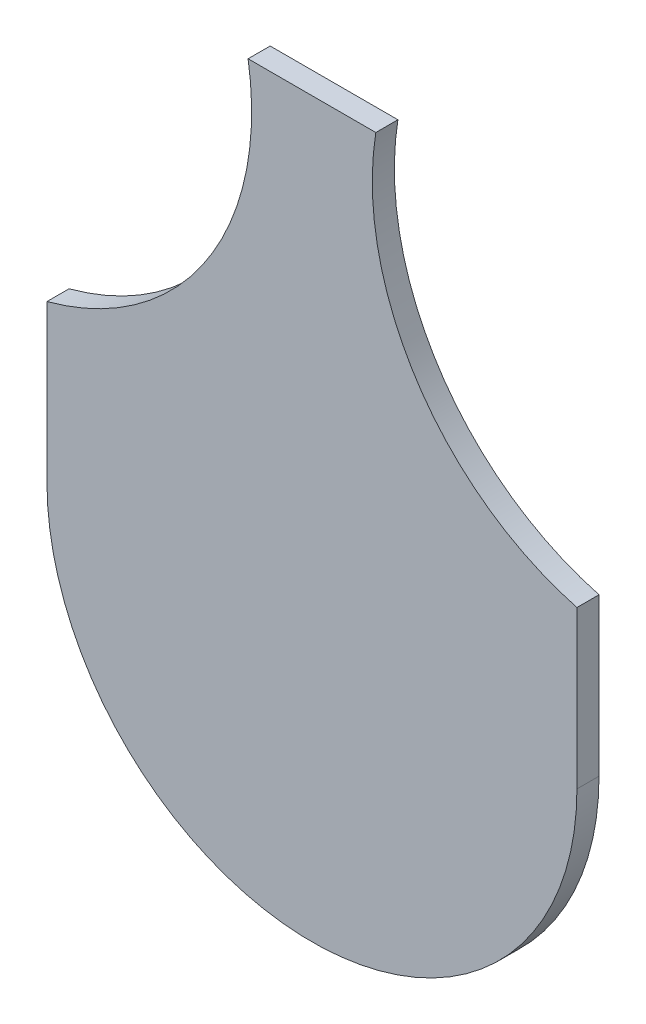
ISO-10303-21;
HEADER;
FILE_DESCRIPTION(('STEP AP214'),'2;1');
FILE_NAME('part.step','',(''),(''),'','','');
FILE_SCHEMA(('AUTOMOTIVE_DESIGN { 1 0 10303 214 1 1 1 1 }'));
ENDSEC;
DATA;
#1=APPLICATION_CONTEXT('core data for automotive mechanical design processes');
#2=APPLICATION_PROTOCOL_DEFINITION('international standard','automotive_design',2000,#1);
#3=PRODUCT_CONTEXT('',#1,'mechanical');
#4=PRODUCT('Part','Part','',(#3));
#5=PRODUCT_RELATED_PRODUCT_CATEGORY('part','',(#4));
#6=PRODUCT_DEFINITION_FORMATION('','',#4);
#7=PRODUCT_DEFINITION_CONTEXT('part definition',#1,'design');
#8=PRODUCT_DEFINITION('design','',#6,#7);
#9=PRODUCT_DEFINITION_SHAPE('','',#8);
#10=(LENGTH_UNIT() NAMED_UNIT(*) SI_UNIT(.MILLI.,.METRE.));
#11=(NAMED_UNIT(*) PLANE_ANGLE_UNIT() SI_UNIT($,.RADIAN.));
#12=(NAMED_UNIT(*) SI_UNIT($,.STERADIAN.) SOLID_ANGLE_UNIT());
#13=UNCERTAINTY_MEASURE_WITH_UNIT(LENGTH_MEASURE(1.E-05),#10,'distance_accuracy_value','');
#14=(GEOMETRIC_REPRESENTATION_CONTEXT(3) GLOBAL_UNCERTAINTY_ASSIGNED_CONTEXT((#13)) GLOBAL_UNIT_ASSIGNED_CONTEXT((#10,
#11,#12)) REPRESENTATION_CONTEXT('',''));
#15=CARTESIAN_POINT('',(0.,0.,0.));
#16=DIRECTION('',(0.,0.,1.));
#17=DIRECTION('',(1.,0.,0.));
#18=AXIS2_PLACEMENT_3D('',#15,#16,#17);
#19=CARTESIAN_POINT('',(0.,0.,5.));
#20=DIRECTION('',(0.,0.,-1.));
#21=DIRECTION('',(-1.,0.,0.));
#22=AXIS2_PLACEMENT_3D('',#19,#20,#21);
#23=CYLINDRICAL_SURFACE('',#22,60.);
#24=CARTESIAN_POINT('',(0.,0.,0.));
#25=DIRECTION('',(0.,0.,1.));
#26=DIRECTION('',(1.,0.,0.));
#27=AXIS2_PLACEMENT_3D('',#24,#25,#26);
#28=CIRCLE('',#27,60.);
#29=CARTESIAN_POINT('',(-60.,0.,0.));
#30=VERTEX_POINT('',#29);
#31=CARTESIAN_POINT('',(60.,-1.38777878078145E-13,0.));
#32=VERTEX_POINT('',#31);
#33=EDGE_CURVE('E121',#30,#32,#28,.T.);
#34=ORIENTED_EDGE('',*,*,#33,.T.);
#35=DIRECTION('',(0.,0.,-1.));
#36=VECTOR('',#35,1.);
#37=CARTESIAN_POINT('',(60.,-1.38777878078145E-13,5.));
#38=LINE('',#37,#36);
#39=CARTESIAN_POINT('',(60.,-1.38777878078145E-13,5.));
#40=VERTEX_POINT('',#39);
#41=EDGE_CURVE('E11',#40,#32,#38,.T.);
#42=ORIENTED_EDGE('',*,*,#41,.F.);
#43=CARTESIAN_POINT('',(0.,0.,5.));
#44=DIRECTION('',(0.,0.,1.));
#45=DIRECTION('',(1.,0.,0.));
#46=AXIS2_PLACEMENT_3D('',#43,#44,#45);
#47=CIRCLE('',#46,60.);
#48=CARTESIAN_POINT('',(-60.,0.,5.));
#49=VERTEX_POINT('',#48);
#50=EDGE_CURVE('E131',#49,#40,#47,.T.);
#51=ORIENTED_EDGE('',*,*,#50,.F.);
#52=DIRECTION('',(0.,0.,-1.));
#53=VECTOR('',#52,1.);
#54=CARTESIAN_POINT('',(-60.,0.,5.));
#55=LINE('',#54,#53);
#56=EDGE_CURVE('E117',#49,#30,#55,.T.);
#57=ORIENTED_EDGE('',*,*,#56,.T.);
#58=EDGE_LOOP('',(#34,#42,#51,#57));
#59=FACE_BOUND('',#58,.T.);
#60=ADVANCED_FACE('F37',(#59),#23,.T.);
#61=CARTESIAN_POINT('',(60.,-1.38777878078145E-13,5.));
#62=DIRECTION('',(-1.,0.,0.));
#63=DIRECTION('',(0.,0.,1.));
#64=AXIS2_PLACEMENT_3D('',#61,#62,#63);
#65=PLANE('',#64);
#66=DIRECTION('',(0.,1.,0.));
#67=VECTOR('',#66,1.);
#68=CARTESIAN_POINT('',(60.,-1.38777878078145E-13,0.));
#69=LINE('',#68,#67);
#70=CARTESIAN_POINT('',(60.,35.5744715664191,0.));
#71=VERTEX_POINT('',#70);
#72=EDGE_CURVE('E124',#32,#71,#69,.T.);
#73=ORIENTED_EDGE('',*,*,#72,.T.);
#74=DIRECTION('',(0.,0.,-1.));
#75=VECTOR('',#74,1.);
#76=CARTESIAN_POINT('',(60.,35.5744715664191,5.));
#77=LINE('',#76,#75);
#78=CARTESIAN_POINT('',(60.,35.5744715664191,5.));
#79=VERTEX_POINT('',#78);
#80=EDGE_CURVE('E45',#79,#71,#77,.T.);
#81=ORIENTED_EDGE('',*,*,#80,.F.);
#82=DIRECTION('',(0.,1.,0.));
#83=VECTOR('',#82,1.);
#84=CARTESIAN_POINT('',(60.,-1.38777878078145E-13,5.));
#85=LINE('',#84,#83);
#86=EDGE_CURVE('E90',#40,#79,#85,.T.);
#87=ORIENTED_EDGE('',*,*,#86,.F.);
#88=ORIENTED_EDGE('',*,*,#41,.T.);
#89=EDGE_LOOP('',(#73,#81,#87,#88));
#90=FACE_BOUND('',#89,.T.);
#91=ADVANCED_FACE('F155',(#90),#65,.F.);
#92=CARTESIAN_POINT('',(76.1566409473311,95.9500705555721,5.));
#93=DIRECTION('',(0.,0.,-1.));
#94=DIRECTION('',(-1.,0.,0.));
#95=AXIS2_PLACEMENT_3D('',#92,#93,#94);
#96=CYLINDRICAL_SURFACE('',#95,62.4999999999999);
#97=CARTESIAN_POINT('',(76.1566409473311,95.9500705555721,0.));
#98=DIRECTION('',(0.,0.,-1.));
#99=DIRECTION('',(-1.,0.,0.));
#100=AXIS2_PLACEMENT_3D('',#97,#98,#99);
#101=CIRCLE('',#100,62.4999999999999);
#102=CARTESIAN_POINT('',(14.4618275510659,105.950070555572,0.));
#103=VERTEX_POINT('',#102);
#104=EDGE_CURVE('E126',#71,#103,#101,.T.);
#105=ORIENTED_EDGE('',*,*,#104,.T.);
#106=DIRECTION('',(0.,0.,-1.));
#107=VECTOR('',#106,1.);
#108=CARTESIAN_POINT('',(14.4618275510659,105.950070555572,5.));
#109=LINE('',#108,#107);
#110=CARTESIAN_POINT('',(14.4618275510659,105.950070555572,5.));
#111=VERTEX_POINT('',#110);
#112=EDGE_CURVE('E112',#111,#103,#109,.T.);
#113=ORIENTED_EDGE('',*,*,#112,.F.);
#114=CARTESIAN_POINT('',(76.1566409473311,95.9500705555721,5.));
#115=DIRECTION('',(0.,0.,-1.));
#116=DIRECTION('',(-1.,0.,0.));
#117=AXIS2_PLACEMENT_3D('',#114,#115,#116);
#118=CIRCLE('',#117,62.4999999999999);
#119=EDGE_CURVE('E103',#79,#111,#118,.T.);
#120=ORIENTED_EDGE('',*,*,#119,.F.);
#121=ORIENTED_EDGE('',*,*,#80,.T.);
#122=EDGE_LOOP('',(#105,#113,#120,#121));
#123=FACE_BOUND('',#122,.T.);
#124=ADVANCED_FACE('F137',(#123),#96,.F.);
#125=CARTESIAN_POINT('',(-14.4618275510656,105.950070555572,5.));
#126=DIRECTION('',(0.,-1.,0.));
#127=DIRECTION('',(1.,0.,0.));
#128=AXIS2_PLACEMENT_3D('',#125,#126,#127);
#129=PLANE('',#128);
#130=DIRECTION('',(-1.,0.,0.));
#131=VECTOR('',#130,1.);
#132=CARTESIAN_POINT('',(-14.4618275510656,105.950070555572,0.));
#133=LINE('',#132,#131);
#134=CARTESIAN_POINT('',(-14.4618275510656,105.950070555572,0.));
#135=VERTEX_POINT('',#134);
#136=EDGE_CURVE('E111',#103,#135,#133,.T.);
#137=ORIENTED_EDGE('',*,*,#136,.T.);
#138=DIRECTION('',(0.,0.,-1.));
#139=VECTOR('',#138,1.);
#140=CARTESIAN_POINT('',(-14.4618275510656,105.950070555572,5.));
#141=LINE('',#140,#139);
#142=CARTESIAN_POINT('',(-14.4618275510656,105.950070555572,5.));
#143=VERTEX_POINT('',#142);
#144=EDGE_CURVE('E108',#143,#135,#141,.T.);
#145=ORIENTED_EDGE('',*,*,#144,.F.);
#146=DIRECTION('',(-1.,0.,0.));
#147=VECTOR('',#146,1.);
#148=CARTESIAN_POINT('',(-14.4618275510656,105.950070555572,5.));
#149=LINE('',#148,#147);
#150=EDGE_CURVE('E97',#111,#143,#149,.T.);
#151=ORIENTED_EDGE('',*,*,#150,.F.);
#152=ORIENTED_EDGE('',*,*,#112,.T.);
#153=EDGE_LOOP('',(#137,#145,#151,#152));
#154=FACE_BOUND('',#153,.T.);
#155=ADVANCED_FACE('F109',(#154),#129,.F.);
#156=CARTESIAN_POINT('',(-76.1566409473308,95.9500705555723,5.));
#157=DIRECTION('',(0.,0.,-1.));
#158=DIRECTION('',(-1.,0.,0.));
#159=AXIS2_PLACEMENT_3D('',#156,#157,#158);
#160=CYLINDRICAL_SURFACE('',#159,62.4999999999999);
#161=CARTESIAN_POINT('',(-76.1566409473308,95.9500705555723,0.));
#162=DIRECTION('',(0.,0.,-1.));
#163=DIRECTION('',(1.,0.,0.));
#164=AXIS2_PLACEMENT_3D('',#161,#162,#163);
#165=CIRCLE('',#164,62.4999999999999);
#166=CARTESIAN_POINT('',(-60.,35.5744715664192,0.));
#167=VERTEX_POINT('',#166);
#168=EDGE_CURVE('E76',#135,#167,#165,.T.);
#169=ORIENTED_EDGE('',*,*,#168,.T.);
#170=DIRECTION('',(0.,0.,-1.));
#171=VECTOR('',#170,1.);
#172=CARTESIAN_POINT('',(-60.,35.5744715664192,5.));
#173=LINE('',#172,#171);
#174=CARTESIAN_POINT('',(-60.,35.5744715664192,5.));
#175=VERTEX_POINT('',#174);
#176=EDGE_CURVE('E113',#175,#167,#173,.T.);
#177=ORIENTED_EDGE('',*,*,#176,.F.);
#178=CARTESIAN_POINT('',(-76.1566409473308,95.9500705555723,5.));
#179=DIRECTION('',(0.,0.,-1.));
#180=DIRECTION('',(1.,0.,0.));
#181=AXIS2_PLACEMENT_3D('',#178,#179,#180);
#182=CIRCLE('',#181,62.4999999999999);
#183=EDGE_CURVE('E101',#143,#175,#182,.T.);
#184=ORIENTED_EDGE('',*,*,#183,.F.);
#185=ORIENTED_EDGE('',*,*,#144,.T.);
#186=EDGE_LOOP('',(#169,#177,#184,#185));
#187=FACE_BOUND('',#186,.T.);
#188=ADVANCED_FACE('F115',(#187),#160,.F.);
#189=CARTESIAN_POINT('',(-60.,0.,5.));
#190=DIRECTION('',(1.,0.,0.));
#191=DIRECTION('',(0.,0.,-1.));
#192=AXIS2_PLACEMENT_3D('',#189,#190,#191);
#193=PLANE('',#192);
#194=DIRECTION('',(0.,-1.,0.));
#195=VECTOR('',#194,1.);
#196=CARTESIAN_POINT('',(-60.,0.,0.));
#197=LINE('',#196,#195);
#198=EDGE_CURVE('E82',#167,#30,#197,.T.);
#199=ORIENTED_EDGE('',*,*,#198,.T.);
#200=ORIENTED_EDGE('',*,*,#56,.F.);
#201=DIRECTION('',(0.,-1.,0.));
#202=VECTOR('',#201,1.);
#203=CARTESIAN_POINT('',(-60.,0.,5.));
#204=LINE('',#203,#202);
#205=EDGE_CURVE('E53',#175,#49,#204,.T.);
#206=ORIENTED_EDGE('',*,*,#205,.F.);
#207=ORIENTED_EDGE('',*,*,#176,.T.);
#208=EDGE_LOOP('',(#199,#200,#206,#207));
#209=FACE_BOUND('',#208,.T.);
#210=ADVANCED_FACE('F144',(#209),#193,.F.);
#211=CARTESIAN_POINT('',(0.,0.,5.));
#212=DIRECTION('',(0.,0.,1.));
#213=DIRECTION('',(1.,0.,0.));
#214=AXIS2_PLACEMENT_3D('',#211,#212,#213);
#215=PLANE('',#214);
#216=ORIENTED_EDGE('',*,*,#50,.T.);
#217=ORIENTED_EDGE('',*,*,#86,.T.);
#218=ORIENTED_EDGE('',*,*,#119,.T.);
#219=ORIENTED_EDGE('',*,*,#150,.T.);
#220=ORIENTED_EDGE('',*,*,#183,.T.);
#221=ORIENTED_EDGE('',*,*,#205,.T.);
#222=EDGE_LOOP('',(#216,#217,#218,#219,#220,#221));
#223=FACE_BOUND('',#222,.T.);
#224=ADVANCED_FACE('F99',(#223),#215,.T.);
#225=CARTESIAN_POINT('',(0.,0.,0.));
#226=DIRECTION('',(0.,0.,1.));
#227=DIRECTION('',(1.,0.,0.));
#228=AXIS2_PLACEMENT_3D('',#225,#226,#227);
#229=PLANE('',#228);
#230=ORIENTED_EDGE('',*,*,#33,.F.);
#231=ORIENTED_EDGE('',*,*,#198,.F.);
#232=ORIENTED_EDGE('',*,*,#168,.F.);
#233=ORIENTED_EDGE('',*,*,#136,.F.);
#234=ORIENTED_EDGE('',*,*,#104,.F.);
#235=ORIENTED_EDGE('',*,*,#72,.F.);
#236=EDGE_LOOP('',(#230,#231,#232,#233,#234,#235));
#237=FACE_BOUND('',#236,.T.);
#238=ADVANCED_FACE('F140',(#237),#229,.F.);
#239=CLOSED_SHELL('',(#60,#91,#124,#155,#188,#210,#224,#238));
#240=MANIFOLD_SOLID_BREP('B2',#239);
#241=ADVANCED_BREP_SHAPE_REPRESENTATION('',(#18,#240),#14);
#242=SHAPE_DEFINITION_REPRESENTATION(#9,#241);
ENDSEC;
END-ISO-10303-21;
